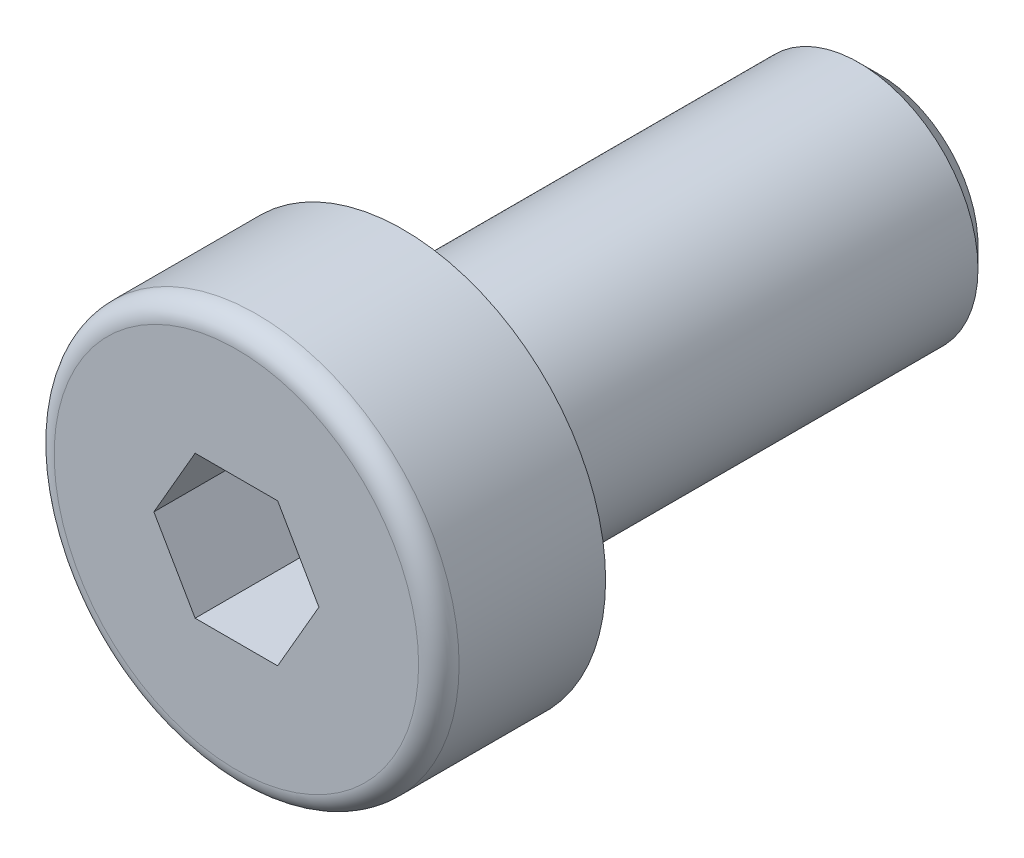
ISO-10303-21;
HEADER;
FILE_DESCRIPTION(('STEP AP214'),'2;1');
FILE_NAME('part.step','',(''),(''),'','','');
FILE_SCHEMA(('AUTOMOTIVE_DESIGN { 1 0 10303 214 1 1 1 1 }'));
ENDSEC;
DATA;
#1=APPLICATION_CONTEXT('core data for automotive mechanical design processes');
#2=APPLICATION_PROTOCOL_DEFINITION('international standard','automotive_design',2000,#1);
#3=PRODUCT_CONTEXT('',#1,'mechanical');
#4=PRODUCT('Part','Part','',(#3));
#5=PRODUCT_RELATED_PRODUCT_CATEGORY('part','',(#4));
#6=PRODUCT_DEFINITION_FORMATION('','',#4);
#7=PRODUCT_DEFINITION_CONTEXT('part definition',#1,'design');
#8=PRODUCT_DEFINITION('design','',#6,#7);
#9=PRODUCT_DEFINITION_SHAPE('','',#8);
#10=(LENGTH_UNIT() NAMED_UNIT(*) SI_UNIT(.MILLI.,.METRE.));
#11=(NAMED_UNIT(*) PLANE_ANGLE_UNIT() SI_UNIT($,.RADIAN.));
#12=(NAMED_UNIT(*) SI_UNIT($,.STERADIAN.) SOLID_ANGLE_UNIT());
#13=UNCERTAINTY_MEASURE_WITH_UNIT(LENGTH_MEASURE(1.E-05),#10,'distance_accuracy_value','');
#14=(GEOMETRIC_REPRESENTATION_CONTEXT(3) GLOBAL_UNCERTAINTY_ASSIGNED_CONTEXT((#13)) GLOBAL_UNIT_ASSIGNED_CONTEXT((#10,
#11,#12)) REPRESENTATION_CONTEXT('',''));
#15=CARTESIAN_POINT('',(0.,0.,0.));
#16=DIRECTION('',(0.,0.,1.));
#17=DIRECTION('',(1.,0.,0.));
#18=AXIS2_PLACEMENT_3D('',#15,#16,#17);
#19=CARTESIAN_POINT('',(0.,0.,3.5));
#20=DIRECTION('',(0.,0.,1.));
#21=DIRECTION('',(1.,0.,0.));
#22=AXIS2_PLACEMENT_3D('',#19,#20,#21);
#23=CYLINDRICAL_SURFACE('',#22,2.5);
#24=CARTESIAN_POINT('',(0.,0.,-0.25));
#25=DIRECTION('',(0.,0.,-1.));
#26=DIRECTION('',(-1.,0.,0.));
#27=AXIS2_PLACEMENT_3D('',#24,#25,#26);
#28=CIRCLE('',#27,2.5);
#29=CARTESIAN_POINT('',(-2.5,0.,-0.25));
#30=VERTEX_POINT('',#29);
#31=EDGE_CURVE('E257',#30,#30,#28,.T.);
#32=ORIENTED_EDGE('',*,*,#31,.T.);
#33=EDGE_LOOP('',(#32));
#34=FACE_BOUND('',#33,.T.);
#35=CARTESIAN_POINT('',(0.,0.,-0.255));
#36=DIRECTION('',(0.,0.,1.));
#37=DIRECTION('',(1.,0.,0.));
#38=AXIS2_PLACEMENT_3D('',#35,#36,#37);
#39=CIRCLE('',#38,2.5);
#40=CARTESIAN_POINT('',(2.5,0.,-0.255));
#41=VERTEX_POINT('',#40);
#42=EDGE_CURVE('E348',#41,#41,#39,.T.);
#43=ORIENTED_EDGE('',*,*,#42,.T.);
#44=EDGE_LOOP('',(#43));
#45=FACE_BOUND('',#44,.T.);
#46=ADVANCED_FACE('F42',(#34,#45),#23,.T.);
#47=CARTESIAN_POINT('',(0.,0.,3.5));
#48=DIRECTION('',(0.,0.,1.));
#49=DIRECTION('',(1.,0.,0.));
#50=AXIS2_PLACEMENT_3D('',#47,#48,#49);
#51=PLANE('',#50);
#52=CARTESIAN_POINT('',(0.,0.,3.5));
#53=DIRECTION('',(0.,0.,1.));
#54=DIRECTION('',(1.,0.,0.));
#55=AXIS2_PLACEMENT_3D('',#52,#53,#54);
#56=CIRCLE('',#55,3.825);
#57=CARTESIAN_POINT('',(3.825,0.,3.5));
#58=VERTEX_POINT('',#57);
#59=EDGE_CURVE('E50',#58,#58,#56,.T.);
#60=ORIENTED_EDGE('',*,*,#59,.T.);
#61=EDGE_LOOP('',(#60));
#62=FACE_BOUND('',#61,.T.);
#63=DIRECTION('',(1.,0.,0.));
#64=VECTOR('',#63,1.);
#65=CARTESIAN_POINT('',(-0.866025,1.49999930062484,3.5));
#66=LINE('',#65,#64);
#67=CARTESIAN_POINT('',(-0.866025,1.49999930062484,3.5));
#68=VERTEX_POINT('',#67);
#69=CARTESIAN_POINT('',(0.866025,1.49999930062484,3.5));
#70=VERTEX_POINT('',#69);
#71=EDGE_CURVE('E121',#68,#70,#66,.T.);
#72=ORIENTED_EDGE('',*,*,#71,.T.);
#73=DIRECTION('',(0.5,-0.866025403784438,0.));
#74=VECTOR('',#73,1.);
#75=CARTESIAN_POINT('',(0.866025,1.49999930062484,3.5));
#76=LINE('',#75,#74);
#77=CARTESIAN_POINT('',(1.73205,0.,3.5));
#78=VERTEX_POINT('',#77);
#79=EDGE_CURVE('E57',#70,#78,#76,.T.);
#80=ORIENTED_EDGE('',*,*,#79,.T.);
#81=DIRECTION('',(-0.5,-0.866025403784439,0.));
#82=VECTOR('',#81,1.);
#83=CARTESIAN_POINT('',(1.73205,0.,3.5));
#84=LINE('',#83,#82);
#85=CARTESIAN_POINT('',(0.866025,-1.49999930062484,3.5));
#86=VERTEX_POINT('',#85);
#87=EDGE_CURVE('E176',#78,#86,#84,.T.);
#88=ORIENTED_EDGE('',*,*,#87,.T.);
#89=DIRECTION('',(-1.,0.,0.));
#90=VECTOR('',#89,1.);
#91=CARTESIAN_POINT('',(0.866025,-1.49999930062484,3.5));
#92=LINE('',#91,#90);
#93=CARTESIAN_POINT('',(-0.866025,-1.49999930062484,3.5));
#94=VERTEX_POINT('',#93);
#95=EDGE_CURVE('E277',#86,#94,#92,.T.);
#96=ORIENTED_EDGE('',*,*,#95,.T.);
#97=DIRECTION('',(-0.5,0.866025403784439,0.));
#98=VECTOR('',#97,1.);
#99=CARTESIAN_POINT('',(-0.866025,-1.49999930062484,3.5));
#100=LINE('',#99,#98);
#101=CARTESIAN_POINT('',(-1.73205,0.,3.5));
#102=VERTEX_POINT('',#101);
#103=EDGE_CURVE('E272',#94,#102,#100,.T.);
#104=ORIENTED_EDGE('',*,*,#103,.T.);
#105=DIRECTION('',(0.5,0.866025403784439,0.));
#106=VECTOR('',#105,1.);
#107=CARTESIAN_POINT('',(-1.73205,0.,3.5));
#108=LINE('',#107,#106);
#109=EDGE_CURVE('E129',#102,#68,#108,.T.);
#110=ORIENTED_EDGE('',*,*,#109,.T.);
#111=EDGE_LOOP('',(#72,#80,#88,#96,#104,#110));
#112=FACE_BOUND('',#111,.T.);
#113=ADVANCED_FACE('F228',(#62,#112),#51,.T.);
#114=CARTESIAN_POINT('',(0.,4.25,0.));
#115=DIRECTION('',(0.,0.,-1.));
#116=DIRECTION('',(-1.,0.,0.));
#117=AXIS2_PLACEMENT_3D('',#114,#115,#116);
#118=PLANE('',#117);
#119=CARTESIAN_POINT('',(0.,0.,0.));
#120=DIRECTION('',(0.,0.,-1.));
#121=DIRECTION('',(-1.,0.,0.));
#122=AXIS2_PLACEMENT_3D('',#119,#120,#121);
#123=CIRCLE('',#122,2.75);
#124=CARTESIAN_POINT('',(-2.75,0.,0.));
#125=VERTEX_POINT('',#124);
#126=EDGE_CURVE('E255',#125,#125,#123,.F.);
#127=ORIENTED_EDGE('',*,*,#126,.T.);
#128=EDGE_LOOP('',(#127));
#129=FACE_BOUND('',#128,.T.);
#130=CARTESIAN_POINT('',(0.,0.,0.));
#131=DIRECTION('',(0.,0.,1.));
#132=DIRECTION('',(1.,0.,0.));
#133=AXIS2_PLACEMENT_3D('',#130,#131,#132);
#134=CIRCLE('',#133,4.25);
#135=CARTESIAN_POINT('',(4.25,0.,0.));
#136=VERTEX_POINT('',#135);
#137=EDGE_CURVE('E145',#136,#136,#134,.T.);
#138=ORIENTED_EDGE('',*,*,#137,.F.);
#139=EDGE_LOOP('',(#138));
#140=FACE_BOUND('',#139,.T.);
#141=ADVANCED_FACE('F234',(#129,#140),#118,.T.);
#142=CARTESIAN_POINT('',(0.,0.,3.5));
#143=DIRECTION('',(0.,0.,1.));
#144=DIRECTION('',(1.,0.,0.));
#145=AXIS2_PLACEMENT_3D('',#142,#143,#144);
#146=CYLINDRICAL_SURFACE('',#145,4.25);
#147=CARTESIAN_POINT('',(0.,0.,3.075));
#148=DIRECTION('',(0.,0.,1.));
#149=DIRECTION('',(1.,0.,0.));
#150=AXIS2_PLACEMENT_3D('',#147,#148,#149);
#151=CIRCLE('',#150,4.25);
#152=CARTESIAN_POINT('',(4.25,0.,3.075));
#153=VERTEX_POINT('',#152);
#154=EDGE_CURVE('E12',#153,#153,#151,.F.);
#155=ORIENTED_EDGE('',*,*,#154,.T.);
#156=EDGE_LOOP('',(#155));
#157=FACE_BOUND('',#156,.T.);
#158=ORIENTED_EDGE('',*,*,#137,.T.);
#159=EDGE_LOOP('',(#158));
#160=FACE_BOUND('',#159,.T.);
#161=ADVANCED_FACE('F226',(#157,#160),#146,.T.);
#162=CARTESIAN_POINT('',(0.866025,1.49999930062484,-0.199999533749891));
#163=DIRECTION('',(-0.866025403784438,-0.5,0.));
#164=DIRECTION('',(-0.5,0.866025403784438,0.));
#165=AXIS2_PLACEMENT_3D('',#162,#163,#164);
#166=PLANE('',#165);
#167=DIRECTION('',(0.,0.,1.));
#168=VECTOR('',#167,1.);
#169=CARTESIAN_POINT('',(1.73205,0.,-0.199999533749891));
#170=LINE('',#169,#168);
#171=CARTESIAN_POINT('',(1.73205,0.,0.8));
#172=VERTEX_POINT('',#171);
#173=EDGE_CURVE('E142',#172,#78,#170,.T.);
#174=ORIENTED_EDGE('',*,*,#173,.T.);
#175=ORIENTED_EDGE('',*,*,#79,.F.);
#176=DIRECTION('',(0.,0.,1.));
#177=VECTOR('',#176,1.);
#178=CARTESIAN_POINT('',(0.866025,1.49999930062484,-0.199999533749891));
#179=LINE('',#178,#177);
#180=CARTESIAN_POINT('',(0.866025,1.49999930062484,0.8));
#181=VERTEX_POINT('',#180);
#182=EDGE_CURVE('E114',#181,#70,#179,.T.);
#183=ORIENTED_EDGE('',*,*,#182,.F.);
#184=CARTESIAN_POINT('',(1.73205115470054,-2.E-06,0.800000666667334));
#185=CARTESIAN_POINT('',(1.69399458130122,0.0659139186895893,0.778022281002605));
#186=CARTESIAN_POINT('',(1.65560950414464,0.132398822577242,0.758034081140541));
#187=CARTESIAN_POINT('',(1.57817473630843,0.266519774741864,0.723145259418736));
#188=CARTESIAN_POINT('',(1.53912367019894,0.334158205333232,0.708256978587658));
#189=CARTESIAN_POINT('',(1.46150547885139,0.468596856338784,0.685082269839176));
#190=CARTESIAN_POINT('',(1.42295029290091,0.535376397300293,0.676641583852306));
#191=CARTESIAN_POINT('',(1.34565859846878,0.669249539059823,0.66656700525616));
#192=CARTESIAN_POINT('',(1.30692237073331,0.736342653591208,0.664924768071326));
#193=CARTESIAN_POINT('',(1.23454773253413,0.861699204131608,0.668349698010666));
#194=CARTESIAN_POINT('',(1.20089846229767,0.919981449818777,0.672575931251664));
#195=CARTESIAN_POINT('',(1.1338191361032,1.03616625092508,0.685967966699277));
#196=CARTESIAN_POINT('',(1.10038931198579,1.09406840478452,0.69513833923059));
#197=CARTESIAN_POINT('',(1.03317179328088,1.21049256234014,0.718062521288176));
#198=CARTESIAN_POINT('',(0.999392601793288,1.26899983823525,0.731913460696617));
#199=CARTESIAN_POINT('',(0.932337893068965,1.38514200063251,0.763349247313548));
#200=CARTESIAN_POINT('',(0.89906151743008,1.4427783739308,0.780926712986003));
#201=CARTESIAN_POINT('',(0.866023845299461,1.50000130062484,0.800000666667333));
#202=B_SPLINE_CURVE_WITH_KNOTS('',3,(#184,#185,#186,#187,#188,#189,#190,#191,#192,#193,#194,
#195,#196,#197,#198,#199,#200,#201),.UNSPECIFIED.,.F.,.F.,(4,2,2,2,2,2,2,2,4),(0.,
0.237762055931485,0.476095461361749,0.708530837844131,0.94068083294838,1.14278193102308,
1.34507017093339,1.55184422617205,1.75821246569164),.UNSPECIFIED.);
#203=EDGE_CURVE('E106',#172,#181,#202,.T.);
#204=ORIENTED_EDGE('',*,*,#203,.F.);
#205=EDGE_LOOP('',(#174,#175,#183,#204));
#206=FACE_BOUND('',#205,.T.);
#207=ADVANCED_FACE('F115',(#206),#166,.T.);
#208=CARTESIAN_POINT('',(1.73205,0.,-0.199999533749891));
#209=DIRECTION('',(-0.866025403784439,0.5,0.));
#210=DIRECTION('',(0.5,0.866025403784439,0.));
#211=AXIS2_PLACEMENT_3D('',#208,#209,#210);
#212=PLANE('',#211);
#213=DIRECTION('',(0.,0.,1.));
#214=VECTOR('',#213,1.);
#215=CARTESIAN_POINT('',(0.866025,-1.49999930062484,-0.199999533749891));
#216=LINE('',#215,#214);
#217=CARTESIAN_POINT('',(0.866025,-1.49999930062484,0.8));
#218=VERTEX_POINT('',#217);
#219=EDGE_CURVE('E139',#218,#86,#216,.T.);
#220=ORIENTED_EDGE('',*,*,#219,.T.);
#221=ORIENTED_EDGE('',*,*,#87,.F.);
#222=ORIENTED_EDGE('',*,*,#173,.F.);
#223=CARTESIAN_POINT('',(0.866023845299462,-1.50000130062484,0.800000666667333));
#224=CARTESIAN_POINT('',(0.904080418698778,-1.43408538193525,0.778022281002603));
#225=CARTESIAN_POINT('',(0.942465495855361,-1.36760047804759,0.758034081140539));
#226=CARTESIAN_POINT('',(1.01990026369157,-1.23347952588297,0.723145259418736));
#227=CARTESIAN_POINT('',(1.05895132980106,-1.1658410952916,0.708256978587658));
#228=CARTESIAN_POINT('',(1.13656952114861,-1.03140244428605,0.685082269839176));
#229=CARTESIAN_POINT('',(1.1751247070991,-0.964622903324544,0.676641583852306));
#230=CARTESIAN_POINT('',(1.25241640153122,-0.830749761565014,0.66656700525616));
#231=CARTESIAN_POINT('',(1.29115262926669,-0.763656647033629,0.664924768071327));
#232=CARTESIAN_POINT('',(1.36352726746587,-0.638300096493229,0.668349698010667));
#233=CARTESIAN_POINT('',(1.39717653770233,-0.58001785080606,0.672575931251664));
#234=CARTESIAN_POINT('',(1.4642558638968,-0.463833049699756,0.685967966699276));
#235=CARTESIAN_POINT('',(1.49768568801421,-0.405930895840313,0.695138339230589));
#236=CARTESIAN_POINT('',(1.56490320671912,-0.2895067382847,0.718062521288175));
#237=CARTESIAN_POINT('',(1.59868239820671,-0.230999462389589,0.731913460696616));
#238=CARTESIAN_POINT('',(1.66573710693103,-0.114857299992331,0.763349247313548));
#239=CARTESIAN_POINT('',(1.69901348256992,-0.0572209266940349,0.780926712986002));
#240=CARTESIAN_POINT('',(1.73205115470054,1.99999999978475E-06,0.800000666667333));
#241=B_SPLINE_CURVE_WITH_KNOTS('',3,(#223,#224,#225,#226,#227,#228,#229,#230,#231,#232,#233,
#234,#235,#236,#237,#238,#239,#240),.UNSPECIFIED.,.F.,.F.,(4,2,2,2,2,2,2,2,4),(0.,
0.237762055931484,0.476095461361747,0.708530837844129,0.940680832948377,1.14278193102307,
1.34507017093338,1.55184422617205,1.75821246569164),.UNSPECIFIED.);
#242=EDGE_CURVE('E110',#218,#172,#241,.T.);
#243=ORIENTED_EDGE('',*,*,#242,.F.);
#244=EDGE_LOOP('',(#220,#221,#222,#243));
#245=FACE_BOUND('',#244,.T.);
#246=ADVANCED_FACE('F217',(#245),#212,.T.);
#247=CARTESIAN_POINT('',(0.866025,-1.49999930062484,-0.199999533749891));
#248=DIRECTION('',(0.,1.,0.));
#249=DIRECTION('',(1.,0.,0.));
#250=AXIS2_PLACEMENT_3D('',#247,#248,#249);
#251=PLANE('',#250);
#252=DIRECTION('',(0.,0.,1.));
#253=VECTOR('',#252,1.);
#254=CARTESIAN_POINT('',(-0.866025,-1.49999930062484,-0.199999533749891));
#255=LINE('',#254,#253);
#256=CARTESIAN_POINT('',(-0.866025,-1.49999930062484,0.8));
#257=VERTEX_POINT('',#256);
#258=EDGE_CURVE('E136',#257,#94,#255,.T.);
#259=ORIENTED_EDGE('',*,*,#258,.T.);
#260=ORIENTED_EDGE('',*,*,#95,.F.);
#261=ORIENTED_EDGE('',*,*,#219,.F.);
#262=CARTESIAN_POINT('',(-2.24271663728987,-1.49999930062484,1.35775267344394));
#263=CARTESIAN_POINT('',(-2.17794141332338,-1.49999930062484,1.32667596135368));
#264=CARTESIAN_POINT('',(-2.11300852130655,-1.49999930062484,1.29592211621229));
#265=CARTESIAN_POINT('',(-1.98274303131292,-1.49999930062484,1.23524311162405));
#266=CARTESIAN_POINT('',(-1.91741036395219,-1.49999930062484,1.20531810131238));
#267=CARTESIAN_POINT('',(-1.78588635397686,-1.49999930062484,1.14631254095843));
#268=CARTESIAN_POINT('',(-1.71969220663993,-1.49999930062484,1.11723821458641));
#269=CARTESIAN_POINT('',(-1.58674953026847,-1.49999930062484,1.06039396688304));
#270=CARTESIAN_POINT('',(-1.52000103027226,-1.49999930062484,1.03262397772829));
#271=CARTESIAN_POINT('',(-1.38408036083489,-1.49999930062484,0.978025456427312));
#272=CARTESIAN_POINT('',(-1.31489044686774,-1.49999930062484,0.951240511367399));
#273=CARTESIAN_POINT('',(-1.17568875836751,-1.49999930062484,0.89990652822181));
#274=CARTESIAN_POINT('',(-1.10567688208708,-1.49999930062484,0.875357770310233));
#275=CARTESIAN_POINT('',(-0.894522216300188,-1.49999930062484,0.806101083400103));
#276=CARTESIAN_POINT('',(-0.751873977094198,-1.49999930062484,0.7656202744164));
#277=CARTESIAN_POINT('',(-0.535047450977606,-1.49999930062484,0.718664526120298));
#278=CARTESIAN_POINT('',(-0.462365424606466,-1.49999930062484,0.705312916880685));
#279=CARTESIAN_POINT('',(-0.316183762847225,-1.49999930062484,0.684113476725801));
#280=CARTESIAN_POINT('',(-0.242684183051902,-1.49999930062484,0.676265273880835));
#281=CARTESIAN_POINT('',(-0.0961588910059516,-1.49999930062484,0.666798599340642));
#282=CARTESIAN_POINT('',(-0.0231380525234333,-1.49999930062484,0.665106612399573));
#283=CARTESIAN_POINT('',(0.122783022434076,-1.49999930062484,0.667899487076448));
#284=CARTESIAN_POINT('',(0.195683251161583,-1.49999930062484,0.672384731163704));
#285=CARTESIAN_POINT('',(0.375553746438776,-1.49999930062484,0.690677684919766));
#286=CARTESIAN_POINT('',(0.482175447169201,-1.49999930062484,0.707913541905915));
#287=CARTESIAN_POINT('',(0.693345462539467,-1.49999930062484,0.752359843964661));
#288=CARTESIAN_POINT('',(0.797891117497961,-1.49999930062484,0.779582310809079));
#289=CARTESIAN_POINT('',(0.954250638010105,-1.49999930062484,0.826084935903706));
#290=CARTESIAN_POINT('',(1.00687274480645,-1.49999930062484,0.842747517746455));
#291=CARTESIAN_POINT('',(1.11156919647057,-1.49999930062484,0.877614065620613));
#292=CARTESIAN_POINT('',(1.16364386068557,-1.49999930062484,0.895817069709244));
#293=CARTESIAN_POINT('',(1.26731501755411,-1.49999930062484,0.933500100925809));
#294=CARTESIAN_POINT('',(1.31891159517315,-1.49999930062484,0.952979895973956));
#295=CARTESIAN_POINT('',(1.42169818698628,-1.49999930062484,0.993005803869725));
#296=CARTESIAN_POINT('',(1.47288813079445,-1.49999930062484,1.01355209687612));
#297=CARTESIAN_POINT('',(1.6035520536722,-1.49999930062484,1.06731329701248));
#298=CARTESIAN_POINT('',(1.68276476914258,-1.49999930062484,1.10116251352867));
#299=CARTESIAN_POINT('',(1.84047488481565,-1.49999930062484,1.17049266735));
#300=CARTESIAN_POINT('',(1.9189722309026,-1.49999930062484,1.20597372689195));
#301=CARTESIAN_POINT('',(2.15362957255391,-1.49999930062484,1.31428942992019));
#302=CARTESIAN_POINT('',(2.3089286607519,-1.49999930062484,1.38898549353906));
#303=CARTESIAN_POINT('',(2.61820006623532,-1.49999930062484,1.54151036059574));
#304=CARTESIAN_POINT('',(2.77217051778771,-1.49999930062484,1.61934290231597));
#305=CARTESIAN_POINT('',(3.07905650209162,-1.49999930062484,1.77700931547993));
#306=CARTESIAN_POINT('',(3.23197216581148,-1.49999930062484,1.85684293253984));
#307=CARTESIAN_POINT('',(3.52267476728495,-1.49999930062484,2.01028853935711));
#308=CARTESIAN_POINT('',(3.66052737206611,-1.49999930062484,2.08377655462836));
#309=CARTESIAN_POINT('',(3.93578914881928,-1.49999930062484,2.23158990958268));
#310=CARTESIAN_POINT('',(4.07319830413762,-1.49999930062484,2.30591528025237));
#311=CARTESIAN_POINT('',(4.34732590427536,-1.49999930062483,2.45500351537988));
#312=CARTESIAN_POINT('',(4.48404521696312,-1.49999930062483,2.52976478622522));
#313=CARTESIAN_POINT('',(4.75720742747683,-1.49999930062483,2.67977391809883));
#314=CARTESIAN_POINT('',(4.89365033939364,-1.49999930062484,2.7550217534582));
#315=CARTESIAN_POINT('',(5.02999394665514,-1.49999930062484,2.83044801324501));
#316=B_SPLINE_CURVE_WITH_KNOTS('',3,(#262,#263,#264,#265,#266,#267,#268,#269,#270,#271,#272,
#273,#274,#275,#276,#277,#278,#279,#280,#281,#282,#283,#284,#285,#286,#287,#288,#289,#290,#291,
#292,#293,#294,#295,#296,#297,#298,#299,#300,#301,#302,#303,#304,#305,#306,#307,#308,#309,#310,
#311,#312,#313,#314,#315),.UNSPECIFIED.,.F.,.F.,(4,2,2,2,2,2,2,2,2,2,2,2,2,2,2,2,2,2,2,2,2,2,2,
2,2,2,4),(0.,0.215535408976475,0.431109351318747,0.647990972858705,0.864861304394723,
1.08740082372431,1.30996818700982,1.75384735851117,1.97537373294937,2.19688513480997,
2.41574248382684,2.63461338422015,2.95796620171825,3.28170955197757,3.44728283297626,
3.61275347131505,3.77819411534645,3.94366279806486,4.20206179692704,4.46048018336434,
4.97740230798824,5.49495989978084,6.01245202818902,6.48110050133561,6.94976637432355,
7.41724019162004,7.88468954517039),.UNSPECIFIED.);
#317=EDGE_CURVE('E207',#257,#218,#316,.T.);
#318=ORIENTED_EDGE('',*,*,#317,.F.);
#319=EDGE_LOOP('',(#259,#260,#261,#318));
#320=FACE_BOUND('',#319,.T.);
#321=ADVANCED_FACE('F213',(#320),#251,.T.);
#322=CARTESIAN_POINT('',(-0.866025,-1.49999930062484,-0.199999533749891));
#323=DIRECTION('',(0.866025403784439,0.5,0.));
#324=DIRECTION('',(0.5,-0.866025403784439,0.));
#325=AXIS2_PLACEMENT_3D('',#322,#323,#324);
#326=PLANE('',#325);
#327=DIRECTION('',(0.,0.,1.));
#328=VECTOR('',#327,1.);
#329=CARTESIAN_POINT('',(-1.73205,0.,-0.199999533749891));
#330=LINE('',#329,#328);
#331=CARTESIAN_POINT('',(-1.73205,0.,0.8));
#332=VERTEX_POINT('',#331);
#333=EDGE_CURVE('E127',#332,#102,#330,.T.);
#334=ORIENTED_EDGE('',*,*,#333,.T.);
#335=ORIENTED_EDGE('',*,*,#103,.F.);
#336=ORIENTED_EDGE('',*,*,#258,.F.);
#337=CARTESIAN_POINT('',(-1.73205115470054,1.99999999944489E-06,0.800000666667333));
#338=CARTESIAN_POINT('',(-1.69399458130122,-0.0659139186895896,0.778022281002604));
#339=CARTESIAN_POINT('',(-1.65560950414464,-0.132398822577242,0.75803408114054));
#340=CARTESIAN_POINT('',(-1.57817473630843,-0.266519774741865,0.723145259418736));
#341=CARTESIAN_POINT('',(-1.53912367019894,-0.334158205333233,0.708256978587658));
#342=CARTESIAN_POINT('',(-1.46150547885139,-0.468596856338785,0.685082269839176));
#343=CARTESIAN_POINT('',(-1.4229502929009,-0.535376397300293,0.676641583852306));
#344=CARTESIAN_POINT('',(-1.34565859846878,-0.669249539059823,0.66656700525616));
#345=CARTESIAN_POINT('',(-1.30692237073331,-0.736342653591209,0.664924768071326));
#346=CARTESIAN_POINT('',(-1.23454773253413,-0.861699204131608,0.668349698010666));
#347=CARTESIAN_POINT('',(-1.20089846229767,-0.919981449818778,0.672575931251664));
#348=CARTESIAN_POINT('',(-1.1338191361032,-1.03616625092508,0.685967966699277));
#349=CARTESIAN_POINT('',(-1.10038931198579,-1.09406840478452,0.69513833923059));
#350=CARTESIAN_POINT('',(-1.03317179328088,-1.21049256234014,0.718062521288175));
#351=CARTESIAN_POINT('',(-0.999392601793289,-1.26899983823525,0.731913460696616));
#352=CARTESIAN_POINT('',(-0.932337893068967,-1.38514200063251,0.763349247313548));
#353=CARTESIAN_POINT('',(-0.899061517430082,-1.4427783739308,0.780926712986002));
#354=CARTESIAN_POINT('',(-0.866023845299461,-1.50000130062484,0.800000666667333));
#355=B_SPLINE_CURVE_WITH_KNOTS('',3,(#337,#338,#339,#340,#341,#342,#343,#344,#345,#346,#347,
#348,#349,#350,#351,#352,#353,#354),.UNSPECIFIED.,.F.,.F.,(4,2,2,2,2,2,2,2,4),(0.,
0.237762055931485,0.476095461361748,0.708530837844131,0.94068083294838,1.14278193102308,
1.34507017093338,1.55184422617205,1.75821246569164),.UNSPECIFIED.);
#356=EDGE_CURVE('E202',#332,#257,#355,.T.);
#357=ORIENTED_EDGE('',*,*,#356,.F.);
#358=EDGE_LOOP('',(#334,#335,#336,#357));
#359=FACE_BOUND('',#358,.T.);
#360=ADVANCED_FACE('F216',(#359),#326,.T.);
#361=CARTESIAN_POINT('',(-1.73205,0.,-0.199999533749891));
#362=DIRECTION('',(0.866025403784439,-0.5,0.));
#363=DIRECTION('',(-0.5,-0.866025403784439,0.));
#364=AXIS2_PLACEMENT_3D('',#361,#362,#363);
#365=PLANE('',#364);
#366=DIRECTION('',(0.,0.,1.));
#367=VECTOR('',#366,1.);
#368=CARTESIAN_POINT('',(-0.866025,1.49999930062484,-0.199999533749891));
#369=LINE('',#368,#367);
#370=CARTESIAN_POINT('',(-0.866025,1.49999930062484,0.8));
#371=VERTEX_POINT('',#370);
#372=EDGE_CURVE('E120',#371,#68,#369,.T.);
#373=ORIENTED_EDGE('',*,*,#372,.T.);
#374=ORIENTED_EDGE('',*,*,#109,.F.);
#375=ORIENTED_EDGE('',*,*,#333,.F.);
#376=CARTESIAN_POINT('',(-0.866023845299462,1.50000130062484,0.800000666667333));
#377=CARTESIAN_POINT('',(-0.904080418698778,1.43408538193525,0.778022281002603));
#378=CARTESIAN_POINT('',(-0.942465495855361,1.36760047804759,0.75803408114054));
#379=CARTESIAN_POINT('',(-1.01990026369157,1.23347952588297,0.723145259418736));
#380=CARTESIAN_POINT('',(-1.05895132980106,1.1658410952916,0.708256978587657));
#381=CARTESIAN_POINT('',(-1.13656952114861,1.03140244428605,0.685082269839175));
#382=CARTESIAN_POINT('',(-1.1751247070991,0.964622903324544,0.676641583852306));
#383=CARTESIAN_POINT('',(-1.25241640153122,0.830749761565014,0.66656700525616));
#384=CARTESIAN_POINT('',(-1.29115262926669,0.763656647033629,0.664924768071327));
#385=CARTESIAN_POINT('',(-1.36352726746587,0.638300096493229,0.668349698010667));
#386=CARTESIAN_POINT('',(-1.39717653770233,0.58001785080606,0.672575931251664));
#387=CARTESIAN_POINT('',(-1.4642558638968,0.463833049699756,0.685967966699276));
#388=CARTESIAN_POINT('',(-1.49768568801421,0.405930895840313,0.695138339230589));
#389=CARTESIAN_POINT('',(-1.56490320671912,0.289506738284699,0.718062521288175));
#390=CARTESIAN_POINT('',(-1.59868239820671,0.230999462389588,0.731913460696616));
#391=CARTESIAN_POINT('',(-1.66573710693103,0.11485729999233,0.763349247313548));
#392=CARTESIAN_POINT('',(-1.69901348256992,0.0572209266940342,0.780926712986003));
#393=CARTESIAN_POINT('',(-1.73205115470054,-2.00000000048544E-06,0.800000666667334));
#394=B_SPLINE_CURVE_WITH_KNOTS('',3,(#376,#377,#378,#379,#380,#381,#382,#383,#384,#385,#386,
#387,#388,#389,#390,#391,#392,#393),.UNSPECIFIED.,.F.,.F.,(4,2,2,2,2,2,2,2,4),(0.,
0.237762055931484,0.476095461361747,0.708530837844129,0.940680832948377,1.14278193102307,
1.34507017093338,1.55184422617205,1.75821246569164),.UNSPECIFIED.);
#395=EDGE_CURVE('E65',#371,#332,#394,.T.);
#396=ORIENTED_EDGE('',*,*,#395,.F.);
#397=EDGE_LOOP('',(#373,#374,#375,#396));
#398=FACE_BOUND('',#397,.T.);
#399=ADVANCED_FACE('F270',(#398),#365,.T.);
#400=CARTESIAN_POINT('',(-0.866025,1.49999930062484,-0.199999533749891));
#401=DIRECTION('',(0.,-1.,0.));
#402=DIRECTION('',(-1.,0.,0.));
#403=AXIS2_PLACEMENT_3D('',#400,#401,#402);
#404=PLANE('',#403);
#405=ORIENTED_EDGE('',*,*,#182,.T.);
#406=ORIENTED_EDGE('',*,*,#71,.F.);
#407=ORIENTED_EDGE('',*,*,#372,.F.);
#408=CARTESIAN_POINT('',(-2.24271663728987,1.49999930062484,1.35775267344394));
#409=CARTESIAN_POINT('',(-2.17794141332338,1.49999930062484,1.32667596135368));
#410=CARTESIAN_POINT('',(-2.11300852130655,1.49999930062484,1.29592211621229));
#411=CARTESIAN_POINT('',(-1.98274303131292,1.49999930062484,1.23524311162404));
#412=CARTESIAN_POINT('',(-1.91741036395219,1.49999930062484,1.20531810131238));
#413=CARTESIAN_POINT('',(-1.78588635397686,1.49999930062484,1.14631254095843));
#414=CARTESIAN_POINT('',(-1.71969220663993,1.49999930062484,1.11723821458641));
#415=CARTESIAN_POINT('',(-1.58674953026847,1.49999930062484,1.06039396688304));
#416=CARTESIAN_POINT('',(-1.52000103027226,1.49999930062484,1.03262397772829));
#417=CARTESIAN_POINT('',(-1.3840803608349,1.49999930062484,0.978025456427312));
#418=CARTESIAN_POINT('',(-1.31489044686775,1.49999930062484,0.951240511367399));
#419=CARTESIAN_POINT('',(-1.17568875836751,1.49999930062484,0.89990652822181));
#420=CARTESIAN_POINT('',(-1.10567688208708,1.49999930062484,0.875357770310233));
#421=CARTESIAN_POINT('',(-0.89452221630019,1.49999930062484,0.806101083400103));
#422=CARTESIAN_POINT('',(-0.7518739770942,1.49999930062484,0.7656202744164));
#423=CARTESIAN_POINT('',(-0.535047450977608,1.49999930062484,0.718664526120298));
#424=CARTESIAN_POINT('',(-0.462365424606468,1.49999930062484,0.705312916880686));
#425=CARTESIAN_POINT('',(-0.316183762847227,1.49999930062484,0.684113476725801));
#426=CARTESIAN_POINT('',(-0.242684183051904,1.49999930062484,0.676265273880835));
#427=CARTESIAN_POINT('',(-0.0961588910059529,1.49999930062484,0.666798599340642));
#428=CARTESIAN_POINT('',(-0.0231380525234346,1.49999930062484,0.665106612399573));
#429=CARTESIAN_POINT('',(0.122783022434075,1.49999930062484,0.667899487076448));
#430=CARTESIAN_POINT('',(0.195683251161582,1.49999930062484,0.672384731163704));
#431=CARTESIAN_POINT('',(0.375553746438774,1.49999930062484,0.690677684919765));
#432=CARTESIAN_POINT('',(0.4821754471692,1.49999930062484,0.707913541905915));
#433=CARTESIAN_POINT('',(0.693345462539465,1.49999930062484,0.752359843964661));
#434=CARTESIAN_POINT('',(0.797891117497958,1.49999930062484,0.779582310809079));
#435=CARTESIAN_POINT('',(0.954250638010102,1.49999930062484,0.826084935903706));
#436=CARTESIAN_POINT('',(1.00687274480645,1.49999930062484,0.842747517746455));
#437=CARTESIAN_POINT('',(1.11156919647057,1.49999930062484,0.877614065620613));
#438=CARTESIAN_POINT('',(1.16364386068556,1.49999930062484,0.895817069709243));
#439=CARTESIAN_POINT('',(1.2673150175541,1.49999930062484,0.933500100925808));
#440=CARTESIAN_POINT('',(1.31891159517315,1.49999930062484,0.952979895973954));
#441=CARTESIAN_POINT('',(1.42169818698628,1.49999930062484,0.993005803869724));
#442=CARTESIAN_POINT('',(1.47288813079445,1.49999930062484,1.01355209687612));
#443=CARTESIAN_POINT('',(1.60355205367219,1.49999930062484,1.06731329701248));
#444=CARTESIAN_POINT('',(1.68276476914257,1.49999930062484,1.10116251352867));
#445=CARTESIAN_POINT('',(1.84047488481565,1.49999930062484,1.17049266735));
#446=CARTESIAN_POINT('',(1.91897223090259,1.49999930062484,1.20597372689195));
#447=CARTESIAN_POINT('',(2.15362957255391,1.49999930062484,1.31428942992019));
#448=CARTESIAN_POINT('',(2.30892866075189,1.49999930062484,1.38898549353906));
#449=CARTESIAN_POINT('',(2.61820006623532,1.49999930062484,1.54151036059574));
#450=CARTESIAN_POINT('',(2.77217051778771,1.49999930062484,1.61934290231596));
#451=CARTESIAN_POINT('',(3.07905650209162,1.49999930062484,1.77700931547993));
#452=CARTESIAN_POINT('',(3.23197216581148,1.49999930062484,1.85684293253984));
#453=CARTESIAN_POINT('',(3.52267476728495,1.49999930062484,2.01028853935711));
#454=CARTESIAN_POINT('',(3.66052737206611,1.49999930062484,2.08377655462836));
#455=CARTESIAN_POINT('',(3.93578914881928,1.49999930062484,2.23158990958268));
#456=CARTESIAN_POINT('',(4.07319830413761,1.49999930062484,2.30591528025237));
#457=CARTESIAN_POINT('',(4.34732590427536,1.49999930062484,2.45500351537988));
#458=CARTESIAN_POINT('',(4.48404521696312,1.49999930062484,2.52976478622522));
#459=CARTESIAN_POINT('',(4.75720742747683,1.49999930062484,2.67977391809883));
#460=CARTESIAN_POINT('',(4.89365033939364,1.49999930062484,2.7550217534582));
#461=CARTESIAN_POINT('',(5.02999394665514,1.49999930062484,2.83044801324501));
#462=B_SPLINE_CURVE_WITH_KNOTS('',3,(#408,#409,#410,#411,#412,#413,#414,#415,#416,#417,#418,
#419,#420,#421,#422,#423,#424,#425,#426,#427,#428,#429,#430,#431,#432,#433,#434,#435,#436,#437,
#438,#439,#440,#441,#442,#443,#444,#445,#446,#447,#448,#449,#450,#451,#452,#453,#454,#455,#456,
#457,#458,#459,#460,#461),.UNSPECIFIED.,.F.,.F.,(4,2,2,2,2,2,2,2,2,2,2,2,2,2,2,2,2,2,2,2,2,2,2,
2,2,2,4),(0.,0.215535408976475,0.431109351318747,0.647990972858705,0.864861304394722,
1.0874008237243,1.30996818700982,1.75384735851117,1.97537373294937,2.19688513480997,
2.41574248382683,2.63461338422015,2.95796620171825,3.28170955197757,3.44728283297626,
3.61275347131505,3.77819411534645,3.94366279806485,4.20206179692704,4.46048018336433,
4.97740230798823,5.49495989978084,6.01245202818901,6.48110050133561,6.94976637432355,
7.41724019162004,7.88468954517039),.UNSPECIFIED.);
#463=EDGE_CURVE('E107',#181,#371,#462,.F.);
#464=ORIENTED_EDGE('',*,*,#463,.F.);
#465=EDGE_LOOP('',(#405,#406,#407,#464));
#466=FACE_BOUND('',#465,.T.);
#467=ADVANCED_FACE('F102',(#466),#404,.T.);
#468=CARTESIAN_POINT('',(0.,0.,-0.199999533749891));
#469=DIRECTION('',(0.,0.,1.));
#470=DIRECTION('',(1.,0.,0.));
#471=AXIS2_PLACEMENT_3D('',#468,#469,#470);
#472=CONICAL_SURFACE('',#471,0.,1.0471975511966);
#473=CARTESIAN_POINT('',(0.,0.,-0.199999533749891));
#474=VERTEX_POINT('',#473);
#475=VERTEX_LOOP('',#474);
#476=FACE_BOUND('',#475,.T.);
#477=ORIENTED_EDGE('',*,*,#203,.T.);
#478=ORIENTED_EDGE('',*,*,#463,.T.);
#479=ORIENTED_EDGE('',*,*,#395,.T.);
#480=ORIENTED_EDGE('',*,*,#356,.T.);
#481=ORIENTED_EDGE('',*,*,#317,.T.);
#482=ORIENTED_EDGE('',*,*,#242,.T.);
#483=EDGE_LOOP('',(#477,#478,#479,#480,#481,#482));
#484=FACE_BOUND('',#483,.T.);
#485=ADVANCED_FACE('F98',(#476,#484),#472,.F.);
#486=CARTESIAN_POINT('',(0.,0.,-0.255));
#487=DIRECTION('',(0.,0.,1.));
#488=DIRECTION('',(1.,0.,0.));
#489=AXIS2_PLACEMENT_3D('',#486,#487,#488);
#490=CONICAL_SURFACE('',#489,2.5,0.523598775598299);
#491=CARTESIAN_POINT('',(0.,0.,-1.00497799967732));
#492=DIRECTION('',(0.,0.,-1.));
#493=DIRECTION('',(-1.,0.,0.));
#494=AXIS2_PLACEMENT_3D('',#491,#492,#493);
#495=CIRCLE('',#494,2.067);
#496=CARTESIAN_POINT('',(-2.067,0.,-1.00497799967732));
#497=VERTEX_POINT('',#496);
#498=EDGE_CURVE('E355',#497,#497,#495,.F.);
#499=ORIENTED_EDGE('',*,*,#498,.T.);
#500=EDGE_LOOP('',(#499));
#501=FACE_BOUND('',#500,.T.);
#502=ORIENTED_EDGE('',*,*,#42,.F.);
#503=EDGE_LOOP('',(#502));
#504=FACE_BOUND('',#503,.T.);
#505=ADVANCED_FACE('F101',(#501,#504),#490,.T.);
#506=CARTESIAN_POINT('',(0.,0.,-10.));
#507=DIRECTION('',(0.,0.,1.));
#508=DIRECTION('',(1.,0.,0.));
#509=AXIS2_PLACEMENT_3D('',#506,#507,#508);
#510=CYLINDRICAL_SURFACE('',#509,2.5);
#511=CARTESIAN_POINT('',(0.,0.,-9.567));
#512=DIRECTION('',(0.,0.,-1.));
#513=DIRECTION('',(-1.,0.,0.));
#514=AXIS2_PLACEMENT_3D('',#511,#512,#513);
#515=CIRCLE('',#514,2.5);
#516=CARTESIAN_POINT('',(-2.5,0.,-9.567));
#517=VERTEX_POINT('',#516);
#518=EDGE_CURVE('E150',#517,#517,#515,.F.);
#519=ORIENTED_EDGE('',*,*,#518,.T.);
#520=EDGE_LOOP('',(#519));
#521=FACE_BOUND('',#520,.T.);
#522=CARTESIAN_POINT('',(0.,0.,-1.00497799967732));
#523=DIRECTION('',(0.,0.,1.));
#524=DIRECTION('',(-1.,0.,0.));
#525=AXIS2_PLACEMENT_3D('',#522,#523,#524);
#526=CIRCLE('',#525,2.5);
#527=CARTESIAN_POINT('',(-2.5,0.,-1.00497799967732));
#528=VERTEX_POINT('',#527);
#529=EDGE_CURVE('E361',#528,#528,#526,.T.);
#530=ORIENTED_EDGE('',*,*,#529,.F.);
#531=EDGE_LOOP('',(#530));
#532=FACE_BOUND('',#531,.T.);
#533=ADVANCED_FACE('F397',(#521,#532),#510,.T.);
#534=CARTESIAN_POINT('',(0.,0.,-10.));
#535=DIRECTION('',(0.,0.,-1.));
#536=DIRECTION('',(-1.,0.,0.));
#537=AXIS2_PLACEMENT_3D('',#534,#535,#536);
#538=PLANE('',#537);
#539=CARTESIAN_POINT('',(0.,0.,-10.));
#540=DIRECTION('',(0.,0.,-1.));
#541=DIRECTION('',(-1.,0.,0.));
#542=AXIS2_PLACEMENT_3D('',#539,#540,#541);
#543=CIRCLE('',#542,2.067);
#544=CARTESIAN_POINT('',(-2.067,0.,-10.));
#545=VERTEX_POINT('',#544);
#546=EDGE_CURVE('E258',#545,#545,#543,.T.);
#547=ORIENTED_EDGE('',*,*,#546,.T.);
#548=EDGE_LOOP('',(#547));
#549=FACE_BOUND('',#548,.T.);
#550=ADVANCED_FACE('F399',(#549),#538,.T.);
#551=CARTESIAN_POINT('',(0.,0.,-1.00497799967732));
#552=DIRECTION('',(0.,0.,-1.));
#553=DIRECTION('',(-1.,0.,0.));
#554=AXIS2_PLACEMENT_3D('',#551,#552,#553);
#555=PLANE('',#554);
#556=ORIENTED_EDGE('',*,*,#498,.F.);
#557=EDGE_LOOP('',(#556));
#558=FACE_BOUND('',#557,.T.);
#559=ORIENTED_EDGE('',*,*,#529,.T.);
#560=EDGE_LOOP('',(#559));
#561=FACE_BOUND('',#560,.T.);
#562=ADVANCED_FACE('F244',(#558,#561),#555,.F.);
#563=CARTESIAN_POINT('',(0.,0.,-9.567));
#564=DIRECTION('',(0.,0.,1.));
#565=DIRECTION('',(1.,0.,0.));
#566=AXIS2_PLACEMENT_3D('',#563,#564,#565);
#567=CONICAL_SURFACE('',#566,2.5,0.785398163397452);
#568=ORIENTED_EDGE('',*,*,#546,.F.);
#569=EDGE_LOOP('',(#568));
#570=FACE_BOUND('',#569,.T.);
#571=ORIENTED_EDGE('',*,*,#518,.F.);
#572=EDGE_LOOP('',(#571));
#573=FACE_BOUND('',#572,.T.);
#574=ADVANCED_FACE('F241',(#570,#573),#567,.T.);
#575=CARTESIAN_POINT('',(0.,0.,-0.25));
#576=DIRECTION('',(0.,0.,-1.));
#577=DIRECTION('',(-1.,0.,0.));
#578=AXIS2_PLACEMENT_3D('',#575,#576,#577);
#579=TOROIDAL_SURFACE('',#578,2.75,0.25);
#580=ORIENTED_EDGE('',*,*,#126,.F.);
#581=EDGE_LOOP('',(#580));
#582=FACE_BOUND('',#581,.T.);
#583=ORIENTED_EDGE('',*,*,#31,.F.);
#584=EDGE_LOOP('',(#583));
#585=FACE_BOUND('',#584,.T.);
#586=ADVANCED_FACE('F243',(#582,#585),#579,.F.);
#587=CARTESIAN_POINT('',(0.,0.,3.075));
#588=DIRECTION('',(0.,0.,1.));
#589=DIRECTION('',(1.,0.,0.));
#590=AXIS2_PLACEMENT_3D('',#587,#588,#589);
#591=TOROIDAL_SURFACE('',#590,3.825,0.425);
#592=ORIENTED_EDGE('',*,*,#154,.F.);
#593=EDGE_LOOP('',(#592));
#594=FACE_BOUND('',#593,.T.);
#595=ORIENTED_EDGE('',*,*,#59,.F.);
#596=EDGE_LOOP('',(#595));
#597=FACE_BOUND('',#596,.T.);
#598=ADVANCED_FACE('F44',(#594,#597),#591,.T.);
#599=CLOSED_SHELL('',(#46,#113,#141,#161,#207,#246,#321,#360,#399,#467,#485,#505,#533,#550,#562,
#574,#586,#598));
#600=MANIFOLD_SOLID_BREP('B2',#599);
#601=ADVANCED_BREP_SHAPE_REPRESENTATION('',(#18,#600),#14);
#602=SHAPE_DEFINITION_REPRESENTATION(#9,#601);
ENDSEC;
END-ISO-10303-21;
